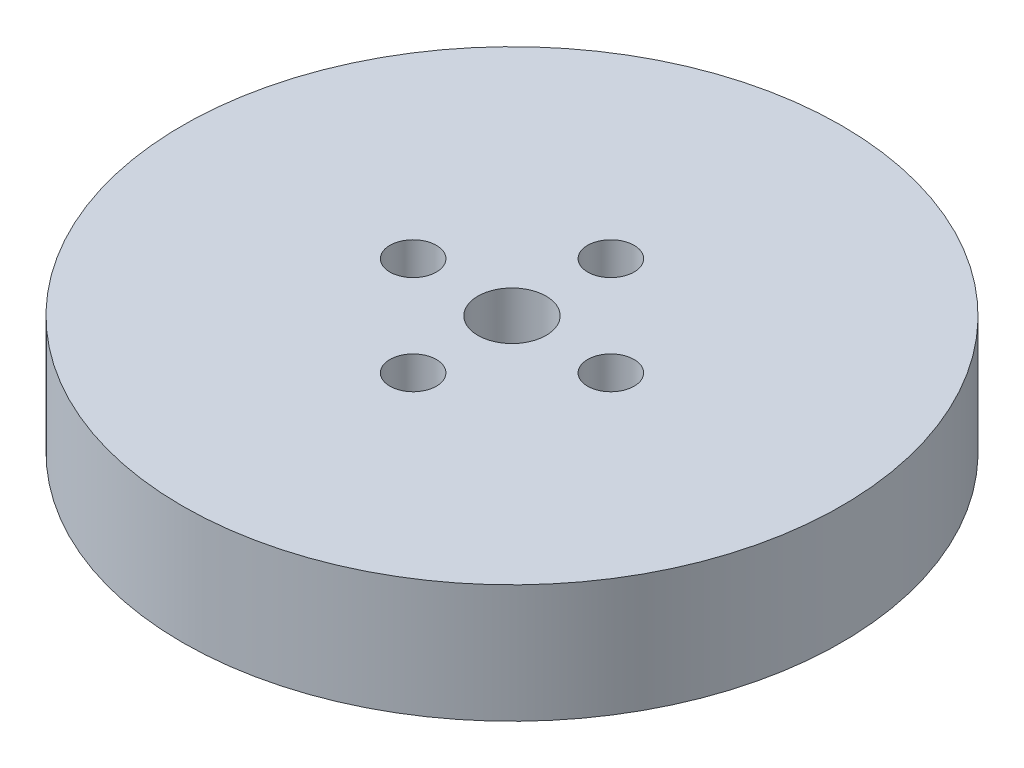
ISO-10303-21;
HEADER;
FILE_DESCRIPTION(('STEP AP214'),'2;1');
FILE_NAME('part.step','',(''),(''),'','','');
FILE_SCHEMA(('AUTOMOTIVE_DESIGN { 1 0 10303 214 1 1 1 1 }'));
ENDSEC;
DATA;
#1=APPLICATION_CONTEXT('core data for automotive mechanical design processes');
#2=APPLICATION_PROTOCOL_DEFINITION('international standard','automotive_design',2000,#1);
#3=PRODUCT_CONTEXT('',#1,'mechanical');
#4=PRODUCT('Part','Part','',(#3));
#5=PRODUCT_RELATED_PRODUCT_CATEGORY('part','',(#4));
#6=PRODUCT_DEFINITION_FORMATION('','',#4);
#7=PRODUCT_DEFINITION_CONTEXT('part definition',#1,'design');
#8=PRODUCT_DEFINITION('design','',#6,#7);
#9=PRODUCT_DEFINITION_SHAPE('','',#8);
#10=(LENGTH_UNIT() NAMED_UNIT(*) SI_UNIT(.MILLI.,.METRE.));
#11=(NAMED_UNIT(*) PLANE_ANGLE_UNIT() SI_UNIT($,.RADIAN.));
#12=(NAMED_UNIT(*) SI_UNIT($,.STERADIAN.) SOLID_ANGLE_UNIT());
#13=UNCERTAINTY_MEASURE_WITH_UNIT(LENGTH_MEASURE(1.E-05),#10,'distance_accuracy_value','');
#14=(GEOMETRIC_REPRESENTATION_CONTEXT(3) GLOBAL_UNCERTAINTY_ASSIGNED_CONTEXT((#13)) GLOBAL_UNIT_ASSIGNED_CONTEXT((#10,
#11,#12)) REPRESENTATION_CONTEXT('',''));
#15=CARTESIAN_POINT('',(0.,0.,0.));
#16=DIRECTION('',(0.,0.,1.));
#17=DIRECTION('',(1.,0.,0.));
#18=AXIS2_PLACEMENT_3D('',#15,#16,#17);
#19=CARTESIAN_POINT('',(0.,26.,0.));
#20=DIRECTION('',(0.,-1.,0.));
#21=DIRECTION('',(0.,0.,-1.));
#22=AXIS2_PLACEMENT_3D('',#19,#20,#21);
#23=CYLINDRICAL_SURFACE('',#22,72.5);
#24=CARTESIAN_POINT('',(0.,26.,0.));
#25=DIRECTION('',(0.,1.,0.));
#26=DIRECTION('',(0.,0.,1.));
#27=AXIS2_PLACEMENT_3D('',#24,#25,#26);
#28=CIRCLE('',#27,72.5);
#29=CARTESIAN_POINT('',(0.,26.,-72.5));
#30=VERTEX_POINT('',#29);
#31=EDGE_CURVE('E10',#30,#30,#28,.T.);
#32=CARTESIAN_POINT('',(0.,0.,0.));
#33=DIRECTION('',(0.,1.,0.));
#34=DIRECTION('',(0.,0.,1.));
#35=AXIS2_PLACEMENT_3D('',#32,#33,#34);
#36=CIRCLE('',#35,72.5);
#37=CARTESIAN_POINT('',(0.,0.,-72.5));
#38=VERTEX_POINT('',#37);
#39=EDGE_CURVE('E37',#38,#38,#36,.T.);
#40=CARTESIAN_POINT('',(0.,26.,-72.5));
#41=CARTESIAN_POINT('',(0.,25.7291666666667,-72.5));
#42=CARTESIAN_POINT('',(0.,25.4583333333333,-72.5));
#43=CARTESIAN_POINT('',(0.,24.9166666666667,-72.5));
#44=CARTESIAN_POINT('',(0.,24.6458333333333,-72.5));
#45=CARTESIAN_POINT('',(0.,24.1041666666667,-72.5));
#46=CARTESIAN_POINT('',(0.,23.8333333333333,-72.5));
#47=CARTESIAN_POINT('',(0.,23.2916666666667,-72.5));
#48=CARTESIAN_POINT('',(0.,23.0208333333333,-72.5));
#49=CARTESIAN_POINT('',(0.,22.4791666666667,-72.5));
#50=CARTESIAN_POINT('',(0.,22.2083333333333,-72.5));
#51=CARTESIAN_POINT('',(0.,21.6666666666667,-72.5));
#52=CARTESIAN_POINT('',(0.,21.3958333333333,-72.5));
#53=CARTESIAN_POINT('',(0.,20.8541666666667,-72.5));
#54=CARTESIAN_POINT('',(0.,20.5833333333333,-72.5));
#55=CARTESIAN_POINT('',(0.,20.0416666666667,-72.5));
#56=CARTESIAN_POINT('',(0.,19.7708333333333,-72.5));
#57=CARTESIAN_POINT('',(0.,19.2291666666667,-72.5));
#58=CARTESIAN_POINT('',(0.,18.9583333333333,-72.5));
#59=CARTESIAN_POINT('',(0.,18.4166666666667,-72.5));
#60=CARTESIAN_POINT('',(0.,18.1458333333333,-72.5));
#61=CARTESIAN_POINT('',(0.,17.6041666666667,-72.5));
#62=CARTESIAN_POINT('',(0.,17.3333333333333,-72.5));
#63=CARTESIAN_POINT('',(0.,16.7916666666667,-72.5));
#64=CARTESIAN_POINT('',(0.,16.5208333333333,-72.5));
#65=CARTESIAN_POINT('',(0.,15.9791666666667,-72.5));
#66=CARTESIAN_POINT('',(0.,15.7083333333333,-72.5));
#67=CARTESIAN_POINT('',(0.,15.1666666666667,-72.5));
#68=CARTESIAN_POINT('',(0.,14.8958333333333,-72.5));
#69=CARTESIAN_POINT('',(0.,14.3541666666667,-72.5));
#70=CARTESIAN_POINT('',(0.,14.0833333333333,-72.5));
#71=CARTESIAN_POINT('',(0.,13.5416666666667,-72.5));
#72=CARTESIAN_POINT('',(0.,13.2708333333333,-72.5));
#73=CARTESIAN_POINT('',(0.,12.7291666666667,-72.5));
#74=CARTESIAN_POINT('',(0.,12.4583333333333,-72.5));
#75=CARTESIAN_POINT('',(0.,11.9166666666667,-72.5));
#76=CARTESIAN_POINT('',(0.,11.6458333333333,-72.5));
#77=CARTESIAN_POINT('',(0.,11.1041666666667,-72.5));
#78=CARTESIAN_POINT('',(0.,10.8333333333333,-72.5));
#79=CARTESIAN_POINT('',(0.,10.2916666666667,-72.5));
#80=CARTESIAN_POINT('',(0.,10.0208333333333,-72.5));
#81=CARTESIAN_POINT('',(0.,9.47916666666667,-72.5));
#82=CARTESIAN_POINT('',(0.,9.20833333333333,-72.5));
#83=CARTESIAN_POINT('',(0.,8.66666666666667,-72.5));
#84=CARTESIAN_POINT('',(0.,8.39583333333333,-72.5));
#85=CARTESIAN_POINT('',(0.,7.85416666666667,-72.5));
#86=CARTESIAN_POINT('',(0.,7.58333333333333,-72.5));
#87=CARTESIAN_POINT('',(0.,7.04166666666667,-72.5));
#88=CARTESIAN_POINT('',(0.,6.77083333333333,-72.5));
#89=CARTESIAN_POINT('',(0.,6.22916666666667,-72.5));
#90=CARTESIAN_POINT('',(0.,5.95833333333333,-72.5));
#91=CARTESIAN_POINT('',(0.,5.41666666666667,-72.5));
#92=CARTESIAN_POINT('',(0.,5.14583333333333,-72.5));
#93=CARTESIAN_POINT('',(0.,4.60416666666667,-72.5));
#94=CARTESIAN_POINT('',(0.,4.33333333333333,-72.5));
#95=CARTESIAN_POINT('',(0.,3.79166666666667,-72.5));
#96=CARTESIAN_POINT('',(0.,3.52083333333333,-72.5));
#97=CARTESIAN_POINT('',(0.,2.97916666666667,-72.5));
#98=CARTESIAN_POINT('',(0.,2.70833333333333,-72.5));
#99=CARTESIAN_POINT('',(0.,2.16666666666667,-72.5));
#100=CARTESIAN_POINT('',(0.,1.89583333333333,-72.5));
#101=CARTESIAN_POINT('',(0.,1.35416666666667,-72.5));
#102=CARTESIAN_POINT('',(0.,1.08333333333333,-72.5));
#103=CARTESIAN_POINT('',(0.,0.541666666666667,-72.5));
#104=CARTESIAN_POINT('',(0.,0.270833333333334,-72.5));
#105=CARTESIAN_POINT('',(0.,0.,-72.5));
#106=B_SPLINE_CURVE_WITH_KNOTS('',3,(#40,#41,#42,#43,#44,#45,#46,#47,#48,#49,#50,#51,#52,#53,
#54,#55,#56,#57,#58,#59,#60,#61,#62,#63,#64,#65,#66,#67,#68,#69,#70,#71,#72,#73,#74,#75,#76,#77,
#78,#79,#80,#81,#82,#83,#84,#85,#86,#87,#88,#89,#90,#91,#92,#93,#94,#95,#96,#97,#98,#99,#100,
#101,#102,#103,#104,#105),.UNSPECIFIED.,.F.,.F.,(4,2,2,2,2,2,2,2,2,2,2,2,2,2,2,2,2,2,2,2,2,2,2,
2,2,2,2,2,2,2,2,2,4),(0.,0.812499999999997,1.625,2.4375,3.25,4.0625,4.875,5.6875,6.5,7.3125,
8.125,8.93749999999999,9.74999999999999,10.5625,11.375,12.1875,13.,13.8125,14.625,15.4375,16.25,
17.0625,17.875,18.6875,19.5,20.3125,21.125,21.9375,22.75,23.5625,24.375,25.1875,26.),.UNSPECIFIED.);
#107=EDGE_CURVE('BSEAM40',#30,#38,#106,.T.);
#108=ORIENTED_EDGE('',*,*,#31,.F.);
#109=ORIENTED_EDGE('',*,*,#39,.T.);
#110=ORIENTED_EDGE('',*,*,#107,.T.);
#111=ORIENTED_EDGE('',*,*,#107,.F.);
#112=EDGE_LOOP('',(#108,#110,#109,#111));
#113=FACE_BOUND('',#112,.T.);
#114=ADVANCED_FACE('F40',(#113),#23,.T.);
#115=CARTESIAN_POINT('',(0.,26.,0.));
#116=DIRECTION('',(0.,1.,0.));
#117=DIRECTION('',(0.,0.,1.));
#118=AXIS2_PLACEMENT_3D('',#115,#116,#117);
#119=PLANE('',#118);
#120=CARTESIAN_POINT('',(0.,26.,21.7488099646616));
#121=DIRECTION('',(0.,1.,0.));
#122=DIRECTION('',(1.,0.,0.));
#123=AXIS2_PLACEMENT_3D('',#120,#121,#122);
#124=CIRCLE('',#123,5.10653547106378);
#125=CARTESIAN_POINT('',(5.10653547106386,26.,21.7488099646616));
#126=VERTEX_POINT('',#125);
#127=EDGE_CURVE('E71',#126,#126,#124,.T.);
#128=ORIENTED_EDGE('',*,*,#127,.F.);
#129=EDGE_LOOP('',(#128));
#130=FACE_BOUND('',#129,.T.);
#131=CARTESIAN_POINT('',(21.7488099646616,26.,0.));
#132=DIRECTION('',(0.,1.,0.));
#133=DIRECTION('',(0.,0.,-1.));
#134=AXIS2_PLACEMENT_3D('',#131,#132,#133);
#135=CIRCLE('',#134,5.10653547106378);
#136=CARTESIAN_POINT('',(21.7488099646616,26.,-5.10653547106378));
#137=VERTEX_POINT('',#136);
#138=EDGE_CURVE('E70',#137,#137,#135,.T.);
#139=ORIENTED_EDGE('',*,*,#138,.F.);
#140=EDGE_LOOP('',(#139));
#141=FACE_BOUND('',#140,.T.);
#142=CARTESIAN_POINT('',(-2.27806692400985E-13,26.,-21.7488099646616));
#143=DIRECTION('',(0.,1.,0.));
#144=DIRECTION('',(-1.,0.,0.));
#145=AXIS2_PLACEMENT_3D('',#142,#143,#144);
#146=CIRCLE('',#145,5.10653547106378);
#147=CARTESIAN_POINT('',(-5.10653547106401,26.,-21.7488099646615));
#148=VERTEX_POINT('',#147);
#149=EDGE_CURVE('E61',#148,#148,#146,.T.);
#150=ORIENTED_EDGE('',*,*,#149,.F.);
#151=EDGE_LOOP('',(#150));
#152=FACE_BOUND('',#151,.T.);
#153=CARTESIAN_POINT('',(-21.7488099646616,26.,0.));
#154=DIRECTION('',(0.,1.,0.));
#155=DIRECTION('',(0.,0.,1.));
#156=AXIS2_PLACEMENT_3D('',#153,#154,#155);
#157=CIRCLE('',#156,5.10653547106378);
#158=CARTESIAN_POINT('',(-21.7488099646616,26.,5.10653547106378));
#159=VERTEX_POINT('',#158);
#160=EDGE_CURVE('E54',#159,#159,#157,.T.);
#161=ORIENTED_EDGE('',*,*,#160,.F.);
#162=EDGE_LOOP('',(#161));
#163=FACE_BOUND('',#162,.T.);
#164=CARTESIAN_POINT('',(0.,26.,0.));
#165=DIRECTION('',(0.,1.,0.));
#166=DIRECTION('',(0.,0.,1.));
#167=AXIS2_PLACEMENT_3D('',#164,#165,#166);
#168=CIRCLE('',#167,7.5);
#169=CARTESIAN_POINT('',(0.,26.,-7.5));
#170=VERTEX_POINT('',#169);
#171=EDGE_CURVE('E50',#170,#170,#168,.T.);
#172=ORIENTED_EDGE('',*,*,#171,.F.);
#173=EDGE_LOOP('',(#172));
#174=FACE_BOUND('',#173,.T.);
#175=ORIENTED_EDGE('',*,*,#31,.T.);
#176=EDGE_LOOP('',(#175));
#177=FACE_BOUND('',#176,.T.);
#178=ADVANCED_FACE('F86',(#130,#141,#152,#163,#174,#177),#119,.T.);
#179=CARTESIAN_POINT('',(0.,0.,0.));
#180=DIRECTION('',(0.,1.,0.));
#181=DIRECTION('',(0.,0.,1.));
#182=AXIS2_PLACEMENT_3D('',#179,#180,#181);
#183=PLANE('',#182);
#184=CARTESIAN_POINT('',(0.,0.,0.));
#185=DIRECTION('',(0.,1.,0.));
#186=DIRECTION('',(0.,0.,1.));
#187=AXIS2_PLACEMENT_3D('',#184,#185,#186);
#188=CIRCLE('',#187,7.5);
#189=CARTESIAN_POINT('',(0.,0.,-7.5));
#190=VERTEX_POINT('',#189);
#191=EDGE_CURVE('E47',#190,#190,#188,.T.);
#192=ORIENTED_EDGE('',*,*,#191,.T.);
#193=EDGE_LOOP('',(#192));
#194=FACE_BOUND('',#193,.T.);
#195=ORIENTED_EDGE('',*,*,#39,.F.);
#196=EDGE_LOOP('',(#195));
#197=FACE_BOUND('',#196,.T.);
#198=ADVANCED_FACE('F93',(#194,#197),#183,.F.);
#199=CARTESIAN_POINT('',(0.,26.,0.));
#200=DIRECTION('',(0.,-1.,0.));
#201=DIRECTION('',(0.,0.,-1.));
#202=AXIS2_PLACEMENT_3D('',#199,#200,#201);
#203=CYLINDRICAL_SURFACE('',#202,7.5);
#204=CARTESIAN_POINT('',(0.,26.,-7.5));
#205=CARTESIAN_POINT('',(0.,25.7291666666667,-7.5));
#206=CARTESIAN_POINT('',(0.,25.4583333333333,-7.5));
#207=CARTESIAN_POINT('',(0.,24.9166666666667,-7.5));
#208=CARTESIAN_POINT('',(0.,24.6458333333333,-7.5));
#209=CARTESIAN_POINT('',(0.,24.1041666666667,-7.5));
#210=CARTESIAN_POINT('',(0.,23.8333333333333,-7.5));
#211=CARTESIAN_POINT('',(0.,23.2916666666667,-7.5));
#212=CARTESIAN_POINT('',(0.,23.0208333333333,-7.5));
#213=CARTESIAN_POINT('',(0.,22.4791666666667,-7.5));
#214=CARTESIAN_POINT('',(0.,22.2083333333333,-7.5));
#215=CARTESIAN_POINT('',(0.,21.6666666666667,-7.5));
#216=CARTESIAN_POINT('',(0.,21.3958333333333,-7.5));
#217=CARTESIAN_POINT('',(0.,20.8541666666667,-7.5));
#218=CARTESIAN_POINT('',(0.,20.5833333333333,-7.5));
#219=CARTESIAN_POINT('',(0.,20.0416666666667,-7.5));
#220=CARTESIAN_POINT('',(0.,19.7708333333333,-7.5));
#221=CARTESIAN_POINT('',(0.,19.2291666666667,-7.5));
#222=CARTESIAN_POINT('',(0.,18.9583333333333,-7.5));
#223=CARTESIAN_POINT('',(0.,18.4166666666667,-7.5));
#224=CARTESIAN_POINT('',(0.,18.1458333333333,-7.5));
#225=CARTESIAN_POINT('',(0.,17.6041666666667,-7.5));
#226=CARTESIAN_POINT('',(0.,17.3333333333333,-7.5));
#227=CARTESIAN_POINT('',(0.,16.7916666666667,-7.5));
#228=CARTESIAN_POINT('',(0.,16.5208333333333,-7.5));
#229=CARTESIAN_POINT('',(0.,15.9791666666667,-7.5));
#230=CARTESIAN_POINT('',(0.,15.7083333333333,-7.5));
#231=CARTESIAN_POINT('',(0.,15.1666666666667,-7.5));
#232=CARTESIAN_POINT('',(0.,14.8958333333333,-7.5));
#233=CARTESIAN_POINT('',(0.,14.3541666666667,-7.5));
#234=CARTESIAN_POINT('',(0.,14.0833333333333,-7.5));
#235=CARTESIAN_POINT('',(0.,13.5416666666667,-7.5));
#236=CARTESIAN_POINT('',(0.,13.2708333333333,-7.5));
#237=CARTESIAN_POINT('',(0.,12.7291666666667,-7.5));
#238=CARTESIAN_POINT('',(0.,12.4583333333333,-7.5));
#239=CARTESIAN_POINT('',(0.,11.9166666666667,-7.5));
#240=CARTESIAN_POINT('',(0.,11.6458333333333,-7.5));
#241=CARTESIAN_POINT('',(0.,11.1041666666667,-7.5));
#242=CARTESIAN_POINT('',(0.,10.8333333333333,-7.5));
#243=CARTESIAN_POINT('',(0.,10.2916666666667,-7.5));
#244=CARTESIAN_POINT('',(0.,10.0208333333333,-7.5));
#245=CARTESIAN_POINT('',(0.,9.47916666666667,-7.5));
#246=CARTESIAN_POINT('',(0.,9.20833333333333,-7.5));
#247=CARTESIAN_POINT('',(0.,8.66666666666667,-7.5));
#248=CARTESIAN_POINT('',(0.,8.39583333333333,-7.5));
#249=CARTESIAN_POINT('',(0.,7.85416666666667,-7.5));
#250=CARTESIAN_POINT('',(0.,7.58333333333333,-7.5));
#251=CARTESIAN_POINT('',(0.,7.04166666666667,-7.5));
#252=CARTESIAN_POINT('',(0.,6.77083333333333,-7.5));
#253=CARTESIAN_POINT('',(0.,6.22916666666667,-7.5));
#254=CARTESIAN_POINT('',(0.,5.95833333333333,-7.5));
#255=CARTESIAN_POINT('',(0.,5.41666666666667,-7.5));
#256=CARTESIAN_POINT('',(0.,5.14583333333333,-7.5));
#257=CARTESIAN_POINT('',(0.,4.60416666666667,-7.5));
#258=CARTESIAN_POINT('',(0.,4.33333333333333,-7.5));
#259=CARTESIAN_POINT('',(0.,3.79166666666667,-7.5));
#260=CARTESIAN_POINT('',(0.,3.52083333333333,-7.5));
#261=CARTESIAN_POINT('',(0.,2.97916666666667,-7.5));
#262=CARTESIAN_POINT('',(0.,2.70833333333333,-7.5));
#263=CARTESIAN_POINT('',(0.,2.16666666666667,-7.5));
#264=CARTESIAN_POINT('',(0.,1.89583333333333,-7.5));
#265=CARTESIAN_POINT('',(0.,1.35416666666667,-7.5));
#266=CARTESIAN_POINT('',(0.,1.08333333333333,-7.5));
#267=CARTESIAN_POINT('',(0.,0.541666666666667,-7.5));
#268=CARTESIAN_POINT('',(0.,0.270833333333334,-7.5));
#269=CARTESIAN_POINT('',(0.,0.,-7.5));
#270=B_SPLINE_CURVE_WITH_KNOTS('',3,(#204,#205,#206,#207,#208,#209,#210,#211,#212,#213,#214,
#215,#216,#217,#218,#219,#220,#221,#222,#223,#224,#225,#226,#227,#228,#229,#230,#231,#232,#233,
#234,#235,#236,#237,#238,#239,#240,#241,#242,#243,#244,#245,#246,#247,#248,#249,#250,#251,#252,
#253,#254,#255,#256,#257,#258,#259,#260,#261,#262,#263,#264,#265,#266,#267,#268,#269),
.UNSPECIFIED.,.F.,.F.,(4,2,2,2,2,2,2,2,2,2,2,2,2,2,2,2,2,2,2,2,2,2,2,2,2,2,2,2,2,2,2,2,4),(0.,
0.812499999999997,1.625,2.4375,3.25,4.0625,4.875,5.6875,6.5,7.3125,8.125,8.93749999999999,
9.74999999999999,10.5625,11.375,12.1875,13.,13.8125,14.625,15.4375,16.25,17.0625,17.875,18.6875,
19.5,20.3125,21.125,21.9375,22.75,23.5625,24.375,25.1875,26.),.UNSPECIFIED.);
#271=EDGE_CURVE('BSEAM101',#170,#190,#270,.T.);
#272=ORIENTED_EDGE('',*,*,#171,.T.);
#273=ORIENTED_EDGE('',*,*,#191,.F.);
#274=ORIENTED_EDGE('',*,*,#271,.T.);
#275=ORIENTED_EDGE('',*,*,#271,.F.);
#276=EDGE_LOOP('',(#272,#274,#273,#275));
#277=FACE_BOUND('',#276,.T.);
#278=ADVANCED_FACE('F101',(#277),#203,.F.);
#279=CARTESIAN_POINT('',(-21.7488099646616,4.3368563211776,0.));
#280=DIRECTION('',(0.,1.,0.));
#281=DIRECTION('',(0.,0.,1.));
#282=AXIS2_PLACEMENT_3D('',#279,#280,#281);
#283=CYLINDRICAL_SURFACE('',#282,5.10653547106378);
#284=CARTESIAN_POINT('',(-21.7488099646616,4.3368563211776,0.));
#285=DIRECTION('',(0.,1.,0.));
#286=DIRECTION('',(0.,0.,1.));
#287=AXIS2_PLACEMENT_3D('',#284,#285,#286);
#288=CIRCLE('',#287,5.10653547106378);
#289=CARTESIAN_POINT('',(-21.7488099646616,4.3368563211776,5.10653547106378));
#290=VERTEX_POINT('',#289);
#291=EDGE_CURVE('E55',#290,#290,#288,.T.);
#292=ORIENTED_EDGE('',*,*,#291,.F.);
#293=EDGE_LOOP('',(#292));
#294=FACE_BOUND('',#293,.T.);
#295=ORIENTED_EDGE('',*,*,#160,.T.);
#296=EDGE_LOOP('',(#295));
#297=FACE_BOUND('',#296,.T.);
#298=ADVANCED_FACE('F102',(#294,#297),#283,.F.);
#299=CARTESIAN_POINT('',(-21.7488099646616,4.3368563211776,0.));
#300=DIRECTION('',(0.,1.,0.));
#301=DIRECTION('',(0.,0.,1.));
#302=AXIS2_PLACEMENT_3D('',#299,#300,#301);
#303=PLANE('',#302);
#304=ORIENTED_EDGE('',*,*,#291,.T.);
#305=EDGE_LOOP('',(#304));
#306=FACE_BOUND('',#305,.T.);
#307=ADVANCED_FACE('F133',(#306),#303,.T.);
#308=CARTESIAN_POINT('',(-2.27806692400985E-13,4.3368563211776,-21.7488099646616));
#309=DIRECTION('',(0.,1.,0.));
#310=DIRECTION('',(0.,0.,1.));
#311=AXIS2_PLACEMENT_3D('',#308,#309,#310);
#312=CYLINDRICAL_SURFACE('',#311,5.10653547106378);
#313=CARTESIAN_POINT('',(-2.27806692400985E-13,4.3368563211776,-21.7488099646616));
#314=DIRECTION('',(0.,1.,0.));
#315=DIRECTION('',(-1.,0.,0.));
#316=AXIS2_PLACEMENT_3D('',#313,#314,#315);
#317=CIRCLE('',#316,5.10653547106378);
#318=CARTESIAN_POINT('',(-5.10653547106401,4.3368563211776,-21.7488099646615));
#319=VERTEX_POINT('',#318);
#320=EDGE_CURVE('E63',#319,#319,#317,.T.);
#321=ORIENTED_EDGE('',*,*,#320,.F.);
#322=EDGE_LOOP('',(#321));
#323=FACE_BOUND('',#322,.T.);
#324=ORIENTED_EDGE('',*,*,#149,.T.);
#325=EDGE_LOOP('',(#324));
#326=FACE_BOUND('',#325,.T.);
#327=ADVANCED_FACE('F142',(#323,#326),#312,.F.);
#328=CARTESIAN_POINT('',(-2.27806692400985E-13,4.3368563211776,-21.7488099646616));
#329=DIRECTION('',(0.,1.,0.));
#330=DIRECTION('',(-1.,0.,0.));
#331=AXIS2_PLACEMENT_3D('',#328,#329,#330);
#332=PLANE('',#331);
#333=ORIENTED_EDGE('',*,*,#320,.T.);
#334=EDGE_LOOP('',(#333));
#335=FACE_BOUND('',#334,.T.);
#336=ADVANCED_FACE('F156',(#335),#332,.T.);
#337=CARTESIAN_POINT('',(21.7488099646616,4.3368563211776,0.));
#338=DIRECTION('',(0.,1.,0.));
#339=DIRECTION('',(0.,0.,1.));
#340=AXIS2_PLACEMENT_3D('',#337,#338,#339);
#341=CYLINDRICAL_SURFACE('',#340,5.10653547106378);
#342=CARTESIAN_POINT('',(21.7488099646616,4.3368563211776,0.));
#343=DIRECTION('',(0.,1.,0.));
#344=DIRECTION('',(0.,0.,-1.));
#345=AXIS2_PLACEMENT_3D('',#342,#343,#344);
#346=CIRCLE('',#345,5.10653547106378);
#347=CARTESIAN_POINT('',(21.7488099646616,4.3368563211776,-5.10653547106378));
#348=VERTEX_POINT('',#347);
#349=EDGE_CURVE('E69',#348,#348,#346,.T.);
#350=ORIENTED_EDGE('',*,*,#349,.F.);
#351=EDGE_LOOP('',(#350));
#352=FACE_BOUND('',#351,.T.);
#353=ORIENTED_EDGE('',*,*,#138,.T.);
#354=EDGE_LOOP('',(#353));
#355=FACE_BOUND('',#354,.T.);
#356=ADVANCED_FACE('F164',(#352,#355),#341,.F.);
#357=CARTESIAN_POINT('',(21.7488099646616,4.3368563211776,0.));
#358=DIRECTION('',(0.,1.,0.));
#359=DIRECTION('',(0.,0.,-1.));
#360=AXIS2_PLACEMENT_3D('',#357,#358,#359);
#361=PLANE('',#360);
#362=ORIENTED_EDGE('',*,*,#349,.T.);
#363=EDGE_LOOP('',(#362));
#364=FACE_BOUND('',#363,.T.);
#365=ADVANCED_FACE('F83',(#364),#361,.T.);
#366=CARTESIAN_POINT('',(0.,4.3368563211776,21.7488099646616));
#367=DIRECTION('',(0.,1.,0.));
#368=DIRECTION('',(0.,0.,1.));
#369=AXIS2_PLACEMENT_3D('',#366,#367,#368);
#370=CYLINDRICAL_SURFACE('',#369,5.10653547106378);
#371=CARTESIAN_POINT('',(0.,4.3368563211776,21.7488099646616));
#372=DIRECTION('',(0.,1.,0.));
#373=DIRECTION('',(1.,0.,0.));
#374=AXIS2_PLACEMENT_3D('',#371,#372,#373);
#375=CIRCLE('',#374,5.10653547106378);
#376=CARTESIAN_POINT('',(5.10653547106386,4.3368563211776,21.7488099646616));
#377=VERTEX_POINT('',#376);
#378=EDGE_CURVE('E59',#377,#377,#375,.T.);
#379=ORIENTED_EDGE('',*,*,#378,.F.);
#380=EDGE_LOOP('',(#379));
#381=FACE_BOUND('',#380,.T.);
#382=ORIENTED_EDGE('',*,*,#127,.T.);
#383=EDGE_LOOP('',(#382));
#384=FACE_BOUND('',#383,.T.);
#385=ADVANCED_FACE('F81',(#381,#384),#370,.F.);
#386=CARTESIAN_POINT('',(0.,4.3368563211776,21.7488099646616));
#387=DIRECTION('',(0.,1.,0.));
#388=DIRECTION('',(1.,0.,0.));
#389=AXIS2_PLACEMENT_3D('',#386,#387,#388);
#390=PLANE('',#389);
#391=ORIENTED_EDGE('',*,*,#378,.T.);
#392=EDGE_LOOP('',(#391));
#393=FACE_BOUND('',#392,.T.);
#394=ADVANCED_FACE('F78',(#393),#390,.T.);
#395=CLOSED_SHELL('',(#114,#178,#198,#278,#298,#307,#327,#336,#356,#365,#385,#394));
#396=MANIFOLD_SOLID_BREP('B2',#395);
#397=ADVANCED_BREP_SHAPE_REPRESENTATION('',(#18,#396),#14);
#398=SHAPE_DEFINITION_REPRESENTATION(#9,#397);
ENDSEC;
END-ISO-10303-21;
